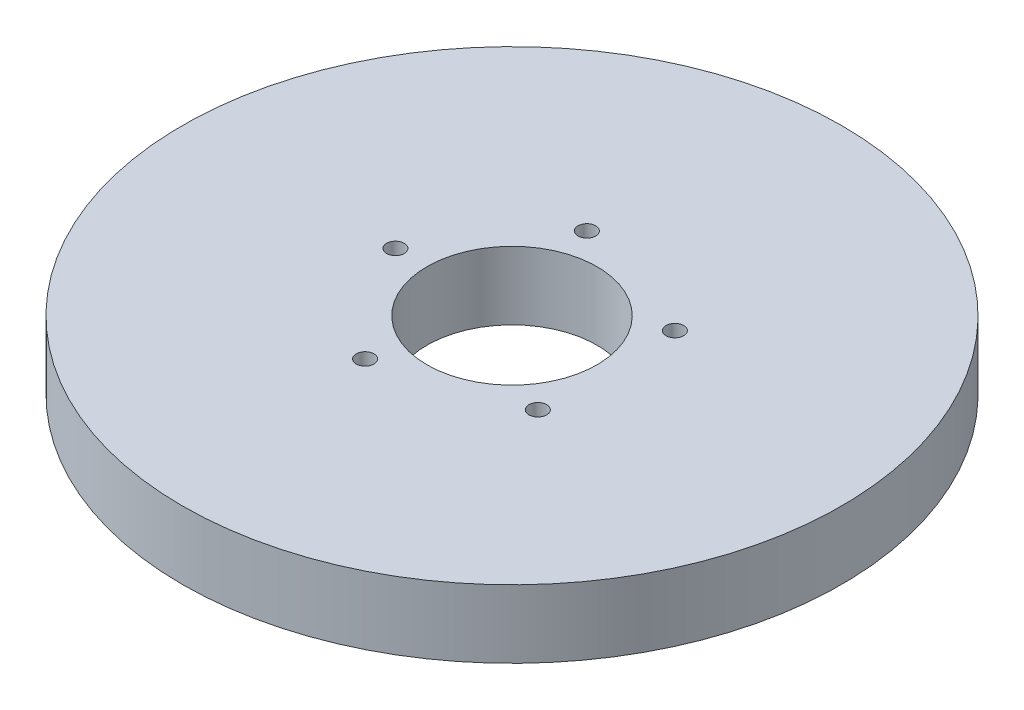
ISO-10303-21;
HEADER;
FILE_DESCRIPTION(('STEP AP214'),'2;1');
FILE_NAME('part.step','',(''),(''),'','','');
FILE_SCHEMA(('AUTOMOTIVE_DESIGN { 1 0 10303 214 1 1 1 1 }'));
ENDSEC;
DATA;
#1=APPLICATION_CONTEXT('core data for automotive mechanical design processes');
#2=APPLICATION_PROTOCOL_DEFINITION('international standard','automotive_design',2000,#1);
#3=PRODUCT_CONTEXT('',#1,'mechanical');
#4=PRODUCT('Part','Part','',(#3));
#5=PRODUCT_RELATED_PRODUCT_CATEGORY('part','',(#4));
#6=PRODUCT_DEFINITION_FORMATION('','',#4);
#7=PRODUCT_DEFINITION_CONTEXT('part definition',#1,'design');
#8=PRODUCT_DEFINITION('design','',#6,#7);
#9=PRODUCT_DEFINITION_SHAPE('','',#8);
#10=(LENGTH_UNIT() NAMED_UNIT(*) SI_UNIT(.MILLI.,.METRE.));
#11=(NAMED_UNIT(*) PLANE_ANGLE_UNIT() SI_UNIT($,.RADIAN.));
#12=(NAMED_UNIT(*) SI_UNIT($,.STERADIAN.) SOLID_ANGLE_UNIT());
#13=UNCERTAINTY_MEASURE_WITH_UNIT(LENGTH_MEASURE(1.E-05),#10,'distance_accuracy_value','');
#14=(GEOMETRIC_REPRESENTATION_CONTEXT(3) GLOBAL_UNCERTAINTY_ASSIGNED_CONTEXT((#13)) GLOBAL_UNIT_ASSIGNED_CONTEXT((#10,
#11,#12)) REPRESENTATION_CONTEXT('',''));
#15=CARTESIAN_POINT('',(0.,0.,0.));
#16=DIRECTION('',(0.,0.,1.));
#17=DIRECTION('',(1.,0.,0.));
#18=AXIS2_PLACEMENT_3D('',#15,#16,#17);
#19=CARTESIAN_POINT('',(0.,16.,0.));
#20=DIRECTION('',(0.,-1.,0.));
#21=DIRECTION('',(0.,0.,-1.));
#22=AXIS2_PLACEMENT_3D('',#19,#20,#21);
#23=CYLINDRICAL_SURFACE('',#22,77.5);
#24=CARTESIAN_POINT('',(0.,16.,0.));
#25=DIRECTION('',(0.,1.,0.));
#26=DIRECTION('',(0.,0.,1.));
#27=AXIS2_PLACEMENT_3D('',#24,#25,#26);
#28=CIRCLE('',#27,77.5);
#29=CARTESIAN_POINT('',(0.,16.,77.5));
#30=VERTEX_POINT('',#29);
#31=EDGE_CURVE('E10',#30,#30,#28,.T.);
#32=ORIENTED_EDGE('',*,*,#31,.F.);
#33=EDGE_LOOP('',(#32));
#34=FACE_BOUND('',#33,.T.);
#35=CARTESIAN_POINT('',(0.,0.,0.));
#36=DIRECTION('',(0.,1.,0.));
#37=DIRECTION('',(0.,0.,1.));
#38=AXIS2_PLACEMENT_3D('',#35,#36,#37);
#39=CIRCLE('',#38,77.5);
#40=CARTESIAN_POINT('',(0.,0.,77.5));
#41=VERTEX_POINT('',#40);
#42=EDGE_CURVE('E37',#41,#41,#39,.T.);
#43=ORIENTED_EDGE('',*,*,#42,.T.);
#44=EDGE_LOOP('',(#43));
#45=FACE_BOUND('',#44,.T.);
#46=ADVANCED_FACE('F40',(#34,#45),#23,.T.);
#47=CARTESIAN_POINT('',(0.,16.,0.));
#48=DIRECTION('',(0.,1.,0.));
#49=DIRECTION('',(0.,0.,1.));
#50=AXIS2_PLACEMENT_3D('',#47,#48,#49);
#51=PLANE('',#50);
#52=CARTESIAN_POINT('',(-8.47301739270724,16.,26.0772661397349));
#53=DIRECTION('',(0.,1.,0.));
#54=DIRECTION('',(0.951056516295155,0.,0.309016994374945));
#55=AXIS2_PLACEMENT_3D('',#52,#53,#54);
#56=CIRCLE('',#55,2.08606824569061);
#57=CARTESIAN_POINT('',(-8.47301739270724,16.,28.1633343854255));
#58=VERTEX_POINT('',#57);
#59=EDGE_CURVE('E78',#58,#58,#56,.T.);
#60=ORIENTED_EDGE('',*,*,#59,.F.);
#61=EDGE_LOOP('',(#60));
#62=FACE_BOUND('',#61,.T.);
#63=CARTESIAN_POINT('',(22.1826475213769,16.,16.1166368080328));
#64=DIRECTION('',(0.,1.,0.));
#65=DIRECTION('',(0.587785252292469,0.,-0.809016994374951));
#66=AXIS2_PLACEMENT_3D('',#63,#64,#65);
#67=CIRCLE('',#66,2.08606824569061);
#68=CARTESIAN_POINT('',(22.1826475213769,16.,18.2027050537234));
#69=VERTEX_POINT('',#68);
#70=EDGE_CURVE('E71',#69,#69,#67,.T.);
#71=ORIENTED_EDGE('',*,*,#70,.F.);
#72=EDGE_LOOP('',(#71));
#73=FACE_BOUND('',#72,.T.);
#74=CARTESIAN_POINT('',(22.1826475213766,16.,-16.1166368080331));
#75=DIRECTION('',(0.,1.,0.));
#76=DIRECTION('',(-0.58778525229248,0.,-0.809016994374942));
#77=AXIS2_PLACEMENT_3D('',#74,#75,#76);
#78=CIRCLE('',#77,2.08606824569061);
#79=CARTESIAN_POINT('',(22.1826475213766,16.,-14.0305685623425));
#80=VERTEX_POINT('',#79);
#81=EDGE_CURVE('E70',#80,#80,#78,.T.);
#82=ORIENTED_EDGE('',*,*,#81,.F.);
#83=EDGE_LOOP('',(#82));
#84=FACE_BOUND('',#83,.T.);
#85=CARTESIAN_POINT('',(-8.47301739270761,16.,-26.0772661397348));
#86=DIRECTION('',(0.,1.,0.));
#87=DIRECTION('',(-0.95105651629515,0.,0.309016994374958));
#88=AXIS2_PLACEMENT_3D('',#85,#86,#87);
#89=CIRCLE('',#88,2.08606824569061);
#90=CARTESIAN_POINT('',(-8.47301739270761,16.,-23.9911978940442));
#91=VERTEX_POINT('',#90);
#92=EDGE_CURVE('E61',#91,#91,#89,.T.);
#93=ORIENTED_EDGE('',*,*,#92,.F.);
#94=EDGE_LOOP('',(#93));
#95=FACE_BOUND('',#94,.T.);
#96=CARTESIAN_POINT('',(-27.4192602573389,16.,0.));
#97=DIRECTION('',(0.,1.,0.));
#98=DIRECTION('',(0.,0.,1.));
#99=AXIS2_PLACEMENT_3D('',#96,#97,#98);
#100=CIRCLE('',#99,2.08606824569061);
#101=CARTESIAN_POINT('',(-27.4192602573389,16.,2.08606824569061));
#102=VERTEX_POINT('',#101);
#103=EDGE_CURVE('E54',#102,#102,#100,.T.);
#104=ORIENTED_EDGE('',*,*,#103,.F.);
#105=EDGE_LOOP('',(#104));
#106=FACE_BOUND('',#105,.T.);
#107=CARTESIAN_POINT('',(0.,16.,0.));
#108=DIRECTION('',(0.,1.,0.));
#109=DIRECTION('',(0.,0.,1.));
#110=AXIS2_PLACEMENT_3D('',#107,#108,#109);
#111=CIRCLE('',#110,20.);
#112=CARTESIAN_POINT('',(0.,16.,20.));
#113=VERTEX_POINT('',#112);
#114=EDGE_CURVE('E50',#113,#113,#111,.T.);
#115=ORIENTED_EDGE('',*,*,#114,.F.);
#116=EDGE_LOOP('',(#115));
#117=FACE_BOUND('',#116,.T.);
#118=ORIENTED_EDGE('',*,*,#31,.T.);
#119=EDGE_LOOP('',(#118));
#120=FACE_BOUND('',#119,.T.);
#121=ADVANCED_FACE('F94',(#62,#73,#84,#95,#106,#117,#120),#51,.T.);
#122=CARTESIAN_POINT('',(0.,0.,0.));
#123=DIRECTION('',(0.,1.,0.));
#124=DIRECTION('',(0.,0.,1.));
#125=AXIS2_PLACEMENT_3D('',#122,#123,#124);
#126=PLANE('',#125);
#127=CARTESIAN_POINT('',(0.,0.,0.));
#128=DIRECTION('',(0.,1.,0.));
#129=DIRECTION('',(0.,0.,1.));
#130=AXIS2_PLACEMENT_3D('',#127,#128,#129);
#131=CIRCLE('',#130,20.);
#132=CARTESIAN_POINT('',(0.,0.,20.));
#133=VERTEX_POINT('',#132);
#134=EDGE_CURVE('E47',#133,#133,#131,.T.);
#135=ORIENTED_EDGE('',*,*,#134,.T.);
#136=EDGE_LOOP('',(#135));
#137=FACE_BOUND('',#136,.T.);
#138=ORIENTED_EDGE('',*,*,#42,.F.);
#139=EDGE_LOOP('',(#138));
#140=FACE_BOUND('',#139,.T.);
#141=ADVANCED_FACE('F100',(#137,#140),#126,.F.);
#142=CARTESIAN_POINT('',(0.,16.,0.));
#143=DIRECTION('',(0.,-1.,0.));
#144=DIRECTION('',(0.,0.,-1.));
#145=AXIS2_PLACEMENT_3D('',#142,#143,#144);
#146=CYLINDRICAL_SURFACE('',#145,20.);
#147=ORIENTED_EDGE('',*,*,#114,.T.);
#148=EDGE_LOOP('',(#147));
#149=FACE_BOUND('',#148,.T.);
#150=ORIENTED_EDGE('',*,*,#134,.F.);
#151=EDGE_LOOP('',(#150));
#152=FACE_BOUND('',#151,.T.);
#153=ADVANCED_FACE('F108',(#149,#152),#146,.F.);
#154=CARTESIAN_POINT('',(-27.4192602573389,1.72376139987765,0.));
#155=DIRECTION('',(0.,1.,0.));
#156=DIRECTION('',(0.,0.,1.));
#157=AXIS2_PLACEMENT_3D('',#154,#155,#156);
#158=CYLINDRICAL_SURFACE('',#157,2.08606824569061);
#159=CARTESIAN_POINT('',(-27.4192602573389,1.72376139987765,0.));
#160=DIRECTION('',(0.,1.,0.));
#161=DIRECTION('',(0.,0.,1.));
#162=AXIS2_PLACEMENT_3D('',#159,#160,#161);
#163=CIRCLE('',#162,2.08606824569061);
#164=CARTESIAN_POINT('',(-27.4192602573389,1.72376139987765,2.08606824569061));
#165=VERTEX_POINT('',#164);
#166=EDGE_CURVE('E55',#165,#165,#163,.T.);
#167=CARTESIAN_POINT('',(-27.4192602573389,1.72376139987765,2.08606824569061));
#168=CARTESIAN_POINT('',(-27.4192602573389,1.87247221862893,2.08606824569061));
#169=CARTESIAN_POINT('',(-27.4192602573389,2.0211830373802,2.08606824569061));
#170=CARTESIAN_POINT('',(-27.4192602573389,2.31860467488275,2.08606824569061));
#171=CARTESIAN_POINT('',(-27.4192602573389,2.46731549363402,2.08606824569061));
#172=CARTESIAN_POINT('',(-27.4192602573389,2.76473713113657,2.08606824569061));
#173=CARTESIAN_POINT('',(-27.4192602573389,2.91344794988785,2.08606824569061));
#174=CARTESIAN_POINT('',(-27.4192602573389,3.2108695873904,2.08606824569061));
#175=CARTESIAN_POINT('',(-27.4192602573389,3.35958040614167,2.08606824569061));
#176=CARTESIAN_POINT('',(-27.4192602573389,3.65700204364422,2.08606824569061));
#177=CARTESIAN_POINT('',(-27.4192602573389,3.8057128623955,2.08606824569061));
#178=CARTESIAN_POINT('',(-27.4192602573389,4.10313449989804,2.08606824569061));
#179=CARTESIAN_POINT('',(-27.4192602573389,4.25184531864932,2.08606824569061));
#180=CARTESIAN_POINT('',(-27.4192602573389,4.54926695615187,2.08606824569061));
#181=CARTESIAN_POINT('',(-27.4192602573389,4.69797777490314,2.08606824569061));
#182=CARTESIAN_POINT('',(-27.4192602573389,4.99539941240569,2.08606824569061));
#183=CARTESIAN_POINT('',(-27.4192602573389,5.14411023115696,2.08606824569061));
#184=CARTESIAN_POINT('',(-27.4192602573389,5.44153186865951,2.08606824569061));
#185=CARTESIAN_POINT('',(-27.4192602573389,5.59024268741079,2.08606824569061));
#186=CARTESIAN_POINT('',(-27.4192602573389,5.88766432491334,2.08606824569061));
#187=CARTESIAN_POINT('',(-27.4192602573389,6.03637514366461,2.08606824569061));
#188=CARTESIAN_POINT('',(-27.4192602573389,6.33379678116716,2.08606824569061));
#189=CARTESIAN_POINT('',(-27.4192602573389,6.48250759991843,2.08606824569061));
#190=CARTESIAN_POINT('',(-27.4192602573389,6.77992923742098,2.08606824569061));
#191=CARTESIAN_POINT('',(-27.4192602573389,6.92864005617226,2.08606824569061));
#192=CARTESIAN_POINT('',(-27.4192602573389,7.22606169367481,2.08606824569061));
#193=CARTESIAN_POINT('',(-27.4192602573389,7.37477251242608,2.08606824569061));
#194=CARTESIAN_POINT('',(-27.4192602573389,7.67219414992863,2.08606824569061));
#195=CARTESIAN_POINT('',(-27.4192602573389,7.8209049686799,2.08606824569061));
#196=CARTESIAN_POINT('',(-27.4192602573389,8.11832660618245,2.08606824569061));
#197=CARTESIAN_POINT('',(-27.4192602573389,8.26703742493373,2.08606824569061));
#198=CARTESIAN_POINT('',(-27.4192602573389,8.56445906243628,2.08606824569061));
#199=CARTESIAN_POINT('',(-27.4192602573389,8.71316988118755,2.08606824569061));
#200=CARTESIAN_POINT('',(-27.4192602573389,9.0105915186901,2.08606824569061));
#201=CARTESIAN_POINT('',(-27.4192602573389,9.15930233744137,2.08606824569061));
#202=CARTESIAN_POINT('',(-27.4192602573389,9.45672397494392,2.08606824569061));
#203=CARTESIAN_POINT('',(-27.4192602573389,9.6054347936952,2.08606824569061));
#204=CARTESIAN_POINT('',(-27.4192602573389,9.90285643119775,2.08606824569061));
#205=CARTESIAN_POINT('',(-27.4192602573389,10.051567249949,2.08606824569061));
#206=CARTESIAN_POINT('',(-27.4192602573389,10.3489888874516,2.08606824569061));
#207=CARTESIAN_POINT('',(-27.4192602573389,10.4976997062028,2.08606824569061));
#208=CARTESIAN_POINT('',(-27.4192602573389,10.7951213437054,2.08606824569061));
#209=CARTESIAN_POINT('',(-27.4192602573389,10.9438321624567,2.08606824569061));
#210=CARTESIAN_POINT('',(-27.4192602573389,11.2412537999592,2.08606824569061));
#211=CARTESIAN_POINT('',(-27.4192602573389,11.3899646187105,2.08606824569061));
#212=CARTESIAN_POINT('',(-27.4192602573389,11.687386256213,2.08606824569061));
#213=CARTESIAN_POINT('',(-27.4192602573389,11.8360970749643,2.08606824569061));
#214=CARTESIAN_POINT('',(-27.4192602573389,12.1335187124669,2.08606824569061));
#215=CARTESIAN_POINT('',(-27.4192602573389,12.2822295312181,2.08606824569061));
#216=CARTESIAN_POINT('',(-27.4192602573389,12.5796511687207,2.08606824569061));
#217=CARTESIAN_POINT('',(-27.4192602573389,12.728361987472,2.08606824569061));
#218=CARTESIAN_POINT('',(-27.4192602573389,13.0257836249745,2.08606824569061));
#219=CARTESIAN_POINT('',(-27.4192602573389,13.1744944437258,2.08606824569061));
#220=CARTESIAN_POINT('',(-27.4192602573389,13.4719160812283,2.08606824569061));
#221=CARTESIAN_POINT('',(-27.4192602573389,13.6206268999796,2.08606824569061));
#222=CARTESIAN_POINT('',(-27.4192602573389,13.9180485374822,2.08606824569061));
#223=CARTESIAN_POINT('',(-27.4192602573389,14.0667593562334,2.08606824569061));
#224=CARTESIAN_POINT('',(-27.4192602573389,14.364180993736,2.08606824569061));
#225=CARTESIAN_POINT('',(-27.4192602573389,14.5128918124873,2.08606824569061));
#226=CARTESIAN_POINT('',(-27.4192602573389,14.8103134499898,2.08606824569061));
#227=CARTESIAN_POINT('',(-27.4192602573389,14.9590242687411,2.08606824569061));
#228=CARTESIAN_POINT('',(-27.4192602573389,15.2564459062436,2.08606824569061));
#229=CARTESIAN_POINT('',(-27.4192602573389,15.4051567249949,2.08606824569061));
#230=CARTESIAN_POINT('',(-27.4192602573389,15.7025783624974,2.08606824569061));
#231=CARTESIAN_POINT('',(-27.4192602573389,15.8512891812487,2.08606824569061));
#232=CARTESIAN_POINT('',(-27.4192602573389,16.,2.08606824569061));
#233=B_SPLINE_CURVE_WITH_KNOTS('',3,(#167,#168,#169,#170,#171,#172,#173,#174,#175,#176,#177,
#178,#179,#180,#181,#182,#183,#184,#185,#186,#187,#188,#189,#190,#191,#192,#193,#194,#195,#196,
#197,#198,#199,#200,#201,#202,#203,#204,#205,#206,#207,#208,#209,#210,#211,#212,#213,#214,#215,
#216,#217,#218,#219,#220,#221,#222,#223,#224,#225,#226,#227,#228,#229,#230,#231,#232),
.UNSPECIFIED.,.F.,.F.,(4,2,2,2,2,2,2,2,2,2,2,2,2,2,2,2,2,2,2,2,2,2,2,2,2,2,2,2,2,2,2,2,4),(0.,
0.446132456253823,0.892264912507647,1.33839736876147,1.78452982501529,2.23066228126912,
2.67679473752294,3.12292719377676,3.56905965003059,4.01519210628441,4.46132456253823,
4.90745701879206,5.35358947504588,5.7997219312997,6.24585438755353,6.69198684380735,
7.13811930006117,7.584251756315,8.03038421256882,8.47651666882264,8.92264912507647,
9.36878158133029,9.81491403758411,10.2610464938379,10.7071789500918,11.1533114063456,
11.5994438625994,12.0455763188532,12.4917087751071,12.9378412313609,13.3839736876147,
13.8301061438685,14.2762386001223),.UNSPECIFIED.);
#234=EDGE_CURVE('BSEAM115',#165,#102,#233,.T.);
#235=ORIENTED_EDGE('',*,*,#166,.F.);
#236=ORIENTED_EDGE('',*,*,#103,.T.);
#237=ORIENTED_EDGE('',*,*,#234,.T.);
#238=ORIENTED_EDGE('',*,*,#234,.F.);
#239=EDGE_LOOP('',(#235,#237,#236,#238));
#240=FACE_BOUND('',#239,.T.);
#241=ADVANCED_FACE('F115',(#240),#158,.F.);
#242=CARTESIAN_POINT('',(-27.4192602573389,1.72376139987765,0.));
#243=DIRECTION('',(0.,1.,0.));
#244=DIRECTION('',(0.,0.,1.));
#245=AXIS2_PLACEMENT_3D('',#242,#243,#244);
#246=PLANE('',#245);
#247=ORIENTED_EDGE('',*,*,#166,.T.);
#248=EDGE_LOOP('',(#247));
#249=FACE_BOUND('',#248,.T.);
#250=ADVANCED_FACE('F142',(#249),#246,.T.);
#251=CARTESIAN_POINT('',(-8.47301739270761,1.72376139987765,-26.0772661397348));
#252=DIRECTION('',(0.,1.,0.));
#253=DIRECTION('',(0.,0.,1.));
#254=AXIS2_PLACEMENT_3D('',#251,#252,#253);
#255=CYLINDRICAL_SURFACE('',#254,2.08606824569061);
#256=CARTESIAN_POINT('',(-8.47301739270761,1.72376139987765,-26.0772661397348));
#257=DIRECTION('',(0.,1.,0.));
#258=DIRECTION('',(-0.95105651629515,0.,0.309016994374958));
#259=AXIS2_PLACEMENT_3D('',#256,#257,#258);
#260=CIRCLE('',#259,2.08606824569061);
#261=CARTESIAN_POINT('',(-8.47301739270761,1.72376139987765,-23.9911978940442));
#262=VERTEX_POINT('',#261);
#263=EDGE_CURVE('E63',#262,#262,#260,.T.);
#264=CARTESIAN_POINT('',(-8.47301739270761,1.72376139987765,-23.9911978940442));
#265=CARTESIAN_POINT('',(-8.47301739270761,1.87247221862893,-23.9911978940442));
#266=CARTESIAN_POINT('',(-8.47301739270761,2.0211830373802,-23.9911978940442));
#267=CARTESIAN_POINT('',(-8.47301739270761,2.31860467488275,-23.9911978940442));
#268=CARTESIAN_POINT('',(-8.47301739270761,2.46731549363402,-23.9911978940442));
#269=CARTESIAN_POINT('',(-8.47301739270761,2.76473713113657,-23.9911978940442));
#270=CARTESIAN_POINT('',(-8.47301739270761,2.91344794988785,-23.9911978940442));
#271=CARTESIAN_POINT('',(-8.47301739270761,3.2108695873904,-23.9911978940442));
#272=CARTESIAN_POINT('',(-8.47301739270761,3.35958040614167,-23.9911978940442));
#273=CARTESIAN_POINT('',(-8.47301739270761,3.65700204364422,-23.9911978940442));
#274=CARTESIAN_POINT('',(-8.47301739270761,3.8057128623955,-23.9911978940442));
#275=CARTESIAN_POINT('',(-8.47301739270761,4.10313449989804,-23.9911978940442));
#276=CARTESIAN_POINT('',(-8.47301739270761,4.25184531864932,-23.9911978940442));
#277=CARTESIAN_POINT('',(-8.47301739270761,4.54926695615187,-23.9911978940442));
#278=CARTESIAN_POINT('',(-8.47301739270761,4.69797777490314,-23.9911978940442));
#279=CARTESIAN_POINT('',(-8.47301739270761,4.99539941240569,-23.9911978940442));
#280=CARTESIAN_POINT('',(-8.47301739270761,5.14411023115696,-23.9911978940442));
#281=CARTESIAN_POINT('',(-8.47301739270761,5.44153186865951,-23.9911978940442));
#282=CARTESIAN_POINT('',(-8.47301739270761,5.59024268741079,-23.9911978940442));
#283=CARTESIAN_POINT('',(-8.47301739270761,5.88766432491334,-23.9911978940442));
#284=CARTESIAN_POINT('',(-8.47301739270761,6.03637514366461,-23.9911978940442));
#285=CARTESIAN_POINT('',(-8.47301739270761,6.33379678116716,-23.9911978940442));
#286=CARTESIAN_POINT('',(-8.47301739270761,6.48250759991843,-23.9911978940442));
#287=CARTESIAN_POINT('',(-8.47301739270761,6.77992923742098,-23.9911978940442));
#288=CARTESIAN_POINT('',(-8.47301739270761,6.92864005617226,-23.9911978940442));
#289=CARTESIAN_POINT('',(-8.47301739270761,7.22606169367481,-23.9911978940442));
#290=CARTESIAN_POINT('',(-8.47301739270761,7.37477251242608,-23.9911978940442));
#291=CARTESIAN_POINT('',(-8.47301739270761,7.67219414992863,-23.9911978940442));
#292=CARTESIAN_POINT('',(-8.47301739270761,7.8209049686799,-23.9911978940442));
#293=CARTESIAN_POINT('',(-8.47301739270761,8.11832660618245,-23.9911978940442));
#294=CARTESIAN_POINT('',(-8.47301739270761,8.26703742493373,-23.9911978940442));
#295=CARTESIAN_POINT('',(-8.47301739270761,8.56445906243628,-23.9911978940442));
#296=CARTESIAN_POINT('',(-8.47301739270761,8.71316988118755,-23.9911978940442));
#297=CARTESIAN_POINT('',(-8.47301739270761,9.0105915186901,-23.9911978940442));
#298=CARTESIAN_POINT('',(-8.47301739270761,9.15930233744137,-23.9911978940442));
#299=CARTESIAN_POINT('',(-8.47301739270761,9.45672397494392,-23.9911978940442));
#300=CARTESIAN_POINT('',(-8.47301739270761,9.6054347936952,-23.9911978940442));
#301=CARTESIAN_POINT('',(-8.47301739270761,9.90285643119775,-23.9911978940442));
#302=CARTESIAN_POINT('',(-8.47301739270761,10.051567249949,-23.9911978940442));
#303=CARTESIAN_POINT('',(-8.47301739270761,10.3489888874516,-23.9911978940442));
#304=CARTESIAN_POINT('',(-8.47301739270761,10.4976997062028,-23.9911978940442));
#305=CARTESIAN_POINT('',(-8.47301739270761,10.7951213437054,-23.9911978940442));
#306=CARTESIAN_POINT('',(-8.47301739270761,10.9438321624567,-23.9911978940442));
#307=CARTESIAN_POINT('',(-8.47301739270761,11.2412537999592,-23.9911978940442));
#308=CARTESIAN_POINT('',(-8.47301739270761,11.3899646187105,-23.9911978940442));
#309=CARTESIAN_POINT('',(-8.47301739270761,11.687386256213,-23.9911978940442));
#310=CARTESIAN_POINT('',(-8.47301739270761,11.8360970749643,-23.9911978940442));
#311=CARTESIAN_POINT('',(-8.47301739270761,12.1335187124669,-23.9911978940442));
#312=CARTESIAN_POINT('',(-8.47301739270761,12.2822295312181,-23.9911978940442));
#313=CARTESIAN_POINT('',(-8.47301739270761,12.5796511687207,-23.9911978940442));
#314=CARTESIAN_POINT('',(-8.47301739270761,12.728361987472,-23.9911978940442));
#315=CARTESIAN_POINT('',(-8.47301739270761,13.0257836249745,-23.9911978940442));
#316=CARTESIAN_POINT('',(-8.47301739270761,13.1744944437258,-23.9911978940442));
#317=CARTESIAN_POINT('',(-8.47301739270761,13.4719160812283,-23.9911978940442));
#318=CARTESIAN_POINT('',(-8.47301739270761,13.6206268999796,-23.9911978940442));
#319=CARTESIAN_POINT('',(-8.47301739270761,13.9180485374822,-23.9911978940442));
#320=CARTESIAN_POINT('',(-8.47301739270761,14.0667593562334,-23.9911978940442));
#321=CARTESIAN_POINT('',(-8.47301739270761,14.364180993736,-23.9911978940442));
#322=CARTESIAN_POINT('',(-8.47301739270761,14.5128918124873,-23.9911978940442));
#323=CARTESIAN_POINT('',(-8.47301739270761,14.8103134499898,-23.9911978940442));
#324=CARTESIAN_POINT('',(-8.47301739270761,14.9590242687411,-23.9911978940442));
#325=CARTESIAN_POINT('',(-8.47301739270761,15.2564459062436,-23.9911978940442));
#326=CARTESIAN_POINT('',(-8.47301739270761,15.4051567249949,-23.9911978940442));
#327=CARTESIAN_POINT('',(-8.47301739270761,15.7025783624974,-23.9911978940442));
#328=CARTESIAN_POINT('',(-8.47301739270761,15.8512891812487,-23.9911978940442));
#329=CARTESIAN_POINT('',(-8.47301739270761,16.,-23.9911978940442));
#330=B_SPLINE_CURVE_WITH_KNOTS('',3,(#264,#265,#266,#267,#268,#269,#270,#271,#272,#273,#274,
#275,#276,#277,#278,#279,#280,#281,#282,#283,#284,#285,#286,#287,#288,#289,#290,#291,#292,#293,
#294,#295,#296,#297,#298,#299,#300,#301,#302,#303,#304,#305,#306,#307,#308,#309,#310,#311,#312,
#313,#314,#315,#316,#317,#318,#319,#320,#321,#322,#323,#324,#325,#326,#327,#328,#329),
.UNSPECIFIED.,.F.,.F.,(4,2,2,2,2,2,2,2,2,2,2,2,2,2,2,2,2,2,2,2,2,2,2,2,2,2,2,2,2,2,2,2,4),(0.,
0.446132456253823,0.892264912507647,1.33839736876147,1.78452982501529,2.23066228126912,
2.67679473752294,3.12292719377676,3.56905965003059,4.01519210628441,4.46132456253823,
4.90745701879206,5.35358947504588,5.7997219312997,6.24585438755353,6.69198684380735,
7.13811930006117,7.584251756315,8.03038421256882,8.47651666882264,8.92264912507647,
9.36878158133029,9.81491403758411,10.2610464938379,10.7071789500918,11.1533114063456,
11.5994438625994,12.0455763188532,12.4917087751071,12.9378412313609,13.3839736876147,
13.8301061438685,14.2762386001223),.UNSPECIFIED.);
#331=EDGE_CURVE('BSEAM147',#262,#91,#330,.T.);
#332=ORIENTED_EDGE('',*,*,#263,.F.);
#333=ORIENTED_EDGE('',*,*,#92,.T.);
#334=ORIENTED_EDGE('',*,*,#331,.T.);
#335=ORIENTED_EDGE('',*,*,#331,.F.);
#336=EDGE_LOOP('',(#332,#334,#333,#335));
#337=FACE_BOUND('',#336,.T.);
#338=ADVANCED_FACE('F147',(#337),#255,.F.);
#339=CARTESIAN_POINT('',(-8.47301739270761,1.72376139987765,-26.0772661397348));
#340=DIRECTION('',(0.,1.,0.));
#341=DIRECTION('',(-0.95105651629515,0.,0.309016994374958));
#342=AXIS2_PLACEMENT_3D('',#339,#340,#341);
#343=PLANE('',#342);
#344=ORIENTED_EDGE('',*,*,#263,.T.);
#345=EDGE_LOOP('',(#344));
#346=FACE_BOUND('',#345,.T.);
#347=ADVANCED_FACE('F163',(#346),#343,.T.);
#348=CARTESIAN_POINT('',(22.1826475213766,1.72376139987765,-16.1166368080331));
#349=DIRECTION('',(0.,1.,0.));
#350=DIRECTION('',(0.,0.,1.));
#351=AXIS2_PLACEMENT_3D('',#348,#349,#350);
#352=CYLINDRICAL_SURFACE('',#351,2.08606824569061);
#353=CARTESIAN_POINT('',(22.1826475213766,1.72376139987765,-16.1166368080331));
#354=DIRECTION('',(0.,1.,0.));
#355=DIRECTION('',(-0.58778525229248,0.,-0.809016994374942));
#356=AXIS2_PLACEMENT_3D('',#353,#354,#355);
#357=CIRCLE('',#356,2.08606824569061);
#358=CARTESIAN_POINT('',(22.1826475213766,1.72376139987765,-14.0305685623425));
#359=VERTEX_POINT('',#358);
#360=EDGE_CURVE('E69',#359,#359,#357,.T.);
#361=CARTESIAN_POINT('',(22.1826475213766,1.72376139987765,-14.0305685623425));
#362=CARTESIAN_POINT('',(22.1826475213766,1.87247221862893,-14.0305685623425));
#363=CARTESIAN_POINT('',(22.1826475213766,2.0211830373802,-14.0305685623425));
#364=CARTESIAN_POINT('',(22.1826475213766,2.31860467488275,-14.0305685623425));
#365=CARTESIAN_POINT('',(22.1826475213766,2.46731549363402,-14.0305685623425));
#366=CARTESIAN_POINT('',(22.1826475213766,2.76473713113657,-14.0305685623425));
#367=CARTESIAN_POINT('',(22.1826475213766,2.91344794988785,-14.0305685623425));
#368=CARTESIAN_POINT('',(22.1826475213766,3.2108695873904,-14.0305685623425));
#369=CARTESIAN_POINT('',(22.1826475213766,3.35958040614167,-14.0305685623425));
#370=CARTESIAN_POINT('',(22.1826475213766,3.65700204364422,-14.0305685623425));
#371=CARTESIAN_POINT('',(22.1826475213766,3.8057128623955,-14.0305685623425));
#372=CARTESIAN_POINT('',(22.1826475213766,4.10313449989804,-14.0305685623425));
#373=CARTESIAN_POINT('',(22.1826475213766,4.25184531864932,-14.0305685623425));
#374=CARTESIAN_POINT('',(22.1826475213766,4.54926695615187,-14.0305685623425));
#375=CARTESIAN_POINT('',(22.1826475213766,4.69797777490314,-14.0305685623425));
#376=CARTESIAN_POINT('',(22.1826475213766,4.99539941240569,-14.0305685623425));
#377=CARTESIAN_POINT('',(22.1826475213766,5.14411023115696,-14.0305685623425));
#378=CARTESIAN_POINT('',(22.1826475213766,5.44153186865951,-14.0305685623425));
#379=CARTESIAN_POINT('',(22.1826475213766,5.59024268741079,-14.0305685623425));
#380=CARTESIAN_POINT('',(22.1826475213766,5.88766432491334,-14.0305685623425));
#381=CARTESIAN_POINT('',(22.1826475213766,6.03637514366461,-14.0305685623425));
#382=CARTESIAN_POINT('',(22.1826475213766,6.33379678116716,-14.0305685623425));
#383=CARTESIAN_POINT('',(22.1826475213766,6.48250759991843,-14.0305685623425));
#384=CARTESIAN_POINT('',(22.1826475213766,6.77992923742098,-14.0305685623425));
#385=CARTESIAN_POINT('',(22.1826475213766,6.92864005617226,-14.0305685623425));
#386=CARTESIAN_POINT('',(22.1826475213766,7.22606169367481,-14.0305685623425));
#387=CARTESIAN_POINT('',(22.1826475213766,7.37477251242608,-14.0305685623425));
#388=CARTESIAN_POINT('',(22.1826475213766,7.67219414992863,-14.0305685623425));
#389=CARTESIAN_POINT('',(22.1826475213766,7.8209049686799,-14.0305685623425));
#390=CARTESIAN_POINT('',(22.1826475213766,8.11832660618245,-14.0305685623425));
#391=CARTESIAN_POINT('',(22.1826475213766,8.26703742493373,-14.0305685623425));
#392=CARTESIAN_POINT('',(22.1826475213766,8.56445906243628,-14.0305685623425));
#393=CARTESIAN_POINT('',(22.1826475213766,8.71316988118755,-14.0305685623425));
#394=CARTESIAN_POINT('',(22.1826475213766,9.0105915186901,-14.0305685623425));
#395=CARTESIAN_POINT('',(22.1826475213766,9.15930233744137,-14.0305685623425));
#396=CARTESIAN_POINT('',(22.1826475213766,9.45672397494392,-14.0305685623425));
#397=CARTESIAN_POINT('',(22.1826475213766,9.6054347936952,-14.0305685623425));
#398=CARTESIAN_POINT('',(22.1826475213766,9.90285643119775,-14.0305685623425));
#399=CARTESIAN_POINT('',(22.1826475213766,10.051567249949,-14.0305685623425));
#400=CARTESIAN_POINT('',(22.1826475213766,10.3489888874516,-14.0305685623425));
#401=CARTESIAN_POINT('',(22.1826475213766,10.4976997062028,-14.0305685623425));
#402=CARTESIAN_POINT('',(22.1826475213766,10.7951213437054,-14.0305685623425));
#403=CARTESIAN_POINT('',(22.1826475213766,10.9438321624567,-14.0305685623425));
#404=CARTESIAN_POINT('',(22.1826475213766,11.2412537999592,-14.0305685623425));
#405=CARTESIAN_POINT('',(22.1826475213766,11.3899646187105,-14.0305685623425));
#406=CARTESIAN_POINT('',(22.1826475213766,11.687386256213,-14.0305685623425));
#407=CARTESIAN_POINT('',(22.1826475213766,11.8360970749643,-14.0305685623425));
#408=CARTESIAN_POINT('',(22.1826475213766,12.1335187124669,-14.0305685623425));
#409=CARTESIAN_POINT('',(22.1826475213766,12.2822295312181,-14.0305685623425));
#410=CARTESIAN_POINT('',(22.1826475213766,12.5796511687207,-14.0305685623425));
#411=CARTESIAN_POINT('',(22.1826475213766,12.728361987472,-14.0305685623425));
#412=CARTESIAN_POINT('',(22.1826475213766,13.0257836249745,-14.0305685623425));
#413=CARTESIAN_POINT('',(22.1826475213766,13.1744944437258,-14.0305685623425));
#414=CARTESIAN_POINT('',(22.1826475213766,13.4719160812283,-14.0305685623425));
#415=CARTESIAN_POINT('',(22.1826475213766,13.6206268999796,-14.0305685623425));
#416=CARTESIAN_POINT('',(22.1826475213766,13.9180485374822,-14.0305685623425));
#417=CARTESIAN_POINT('',(22.1826475213766,14.0667593562334,-14.0305685623425));
#418=CARTESIAN_POINT('',(22.1826475213766,14.364180993736,-14.0305685623425));
#419=CARTESIAN_POINT('',(22.1826475213766,14.5128918124873,-14.0305685623425));
#420=CARTESIAN_POINT('',(22.1826475213766,14.8103134499898,-14.0305685623425));
#421=CARTESIAN_POINT('',(22.1826475213766,14.9590242687411,-14.0305685623425));
#422=CARTESIAN_POINT('',(22.1826475213766,15.2564459062436,-14.0305685623425));
#423=CARTESIAN_POINT('',(22.1826475213766,15.4051567249949,-14.0305685623425));
#424=CARTESIAN_POINT('',(22.1826475213766,15.7025783624974,-14.0305685623425));
#425=CARTESIAN_POINT('',(22.1826475213766,15.8512891812487,-14.0305685623425));
#426=CARTESIAN_POINT('',(22.1826475213766,16.,-14.0305685623425));
#427=B_SPLINE_CURVE_WITH_KNOTS('',3,(#361,#362,#363,#364,#365,#366,#367,#368,#369,#370,#371,
#372,#373,#374,#375,#376,#377,#378,#379,#380,#381,#382,#383,#384,#385,#386,#387,#388,#389,#390,
#391,#392,#393,#394,#395,#396,#397,#398,#399,#400,#401,#402,#403,#404,#405,#406,#407,#408,#409,
#410,#411,#412,#413,#414,#415,#416,#417,#418,#419,#420,#421,#422,#423,#424,#425,#426),
.UNSPECIFIED.,.F.,.F.,(4,2,2,2,2,2,2,2,2,2,2,2,2,2,2,2,2,2,2,2,2,2,2,2,2,2,2,2,2,2,2,2,4),(0.,
0.446132456253823,0.892264912507647,1.33839736876147,1.78452982501529,2.23066228126912,
2.67679473752294,3.12292719377676,3.56905965003059,4.01519210628441,4.46132456253823,
4.90745701879206,5.35358947504588,5.7997219312997,6.24585438755353,6.69198684380735,
7.13811930006117,7.584251756315,8.03038421256882,8.47651666882264,8.92264912507647,
9.36878158133029,9.81491403758411,10.2610464938379,10.7071789500918,11.1533114063456,
11.5994438625994,12.0455763188532,12.4917087751071,12.9378412313609,13.3839736876147,
13.8301061438685,14.2762386001223),.UNSPECIFIED.);
#428=EDGE_CURVE('BSEAM172',#359,#80,#427,.T.);
#429=ORIENTED_EDGE('',*,*,#360,.F.);
#430=ORIENTED_EDGE('',*,*,#81,.T.);
#431=ORIENTED_EDGE('',*,*,#428,.T.);
#432=ORIENTED_EDGE('',*,*,#428,.F.);
#433=EDGE_LOOP('',(#429,#431,#430,#432));
#434=FACE_BOUND('',#433,.T.);
#435=ADVANCED_FACE('F172',(#434),#352,.F.);
#436=CARTESIAN_POINT('',(22.1826475213766,1.72376139987765,-16.1166368080331));
#437=DIRECTION('',(0.,1.,0.));
#438=DIRECTION('',(-0.58778525229248,0.,-0.809016994374942));
#439=AXIS2_PLACEMENT_3D('',#436,#437,#438);
#440=PLANE('',#439);
#441=ORIENTED_EDGE('',*,*,#360,.T.);
#442=EDGE_LOOP('',(#441));
#443=FACE_BOUND('',#442,.T.);
#444=ADVANCED_FACE('F185',(#443),#440,.T.);
#445=CARTESIAN_POINT('',(22.1826475213769,1.72376139987765,16.1166368080328));
#446=DIRECTION('',(0.,1.,0.));
#447=DIRECTION('',(0.,0.,1.));
#448=AXIS2_PLACEMENT_3D('',#445,#446,#447);
#449=CYLINDRICAL_SURFACE('',#448,2.08606824569061);
#450=CARTESIAN_POINT('',(22.1826475213769,1.72376139987765,16.1166368080328));
#451=DIRECTION('',(0.,1.,0.));
#452=DIRECTION('',(0.587785252292469,0.,-0.809016994374951));
#453=AXIS2_PLACEMENT_3D('',#450,#451,#452);
#454=CIRCLE('',#453,2.08606824569061);
#455=CARTESIAN_POINT('',(22.1826475213769,1.72376139987765,18.2027050537234));
#456=VERTEX_POINT('',#455);
#457=EDGE_CURVE('E76',#456,#456,#454,.T.);
#458=CARTESIAN_POINT('',(22.1826475213769,1.72376139987765,18.2027050537234));
#459=CARTESIAN_POINT('',(22.1826475213769,1.87247221862893,18.2027050537234));
#460=CARTESIAN_POINT('',(22.1826475213769,2.0211830373802,18.2027050537234));
#461=CARTESIAN_POINT('',(22.1826475213769,2.31860467488275,18.2027050537234));
#462=CARTESIAN_POINT('',(22.1826475213769,2.46731549363402,18.2027050537234));
#463=CARTESIAN_POINT('',(22.1826475213769,2.76473713113657,18.2027050537234));
#464=CARTESIAN_POINT('',(22.1826475213769,2.91344794988785,18.2027050537234));
#465=CARTESIAN_POINT('',(22.1826475213769,3.2108695873904,18.2027050537234));
#466=CARTESIAN_POINT('',(22.1826475213769,3.35958040614167,18.2027050537234));
#467=CARTESIAN_POINT('',(22.1826475213769,3.65700204364422,18.2027050537234));
#468=CARTESIAN_POINT('',(22.1826475213769,3.8057128623955,18.2027050537234));
#469=CARTESIAN_POINT('',(22.1826475213769,4.10313449989804,18.2027050537234));
#470=CARTESIAN_POINT('',(22.1826475213769,4.25184531864932,18.2027050537234));
#471=CARTESIAN_POINT('',(22.1826475213769,4.54926695615187,18.2027050537234));
#472=CARTESIAN_POINT('',(22.1826475213769,4.69797777490314,18.2027050537234));
#473=CARTESIAN_POINT('',(22.1826475213769,4.99539941240569,18.2027050537234));
#474=CARTESIAN_POINT('',(22.1826475213769,5.14411023115696,18.2027050537234));
#475=CARTESIAN_POINT('',(22.1826475213769,5.44153186865951,18.2027050537234));
#476=CARTESIAN_POINT('',(22.1826475213769,5.59024268741079,18.2027050537234));
#477=CARTESIAN_POINT('',(22.1826475213769,5.88766432491334,18.2027050537234));
#478=CARTESIAN_POINT('',(22.1826475213769,6.03637514366461,18.2027050537234));
#479=CARTESIAN_POINT('',(22.1826475213769,6.33379678116716,18.2027050537234));
#480=CARTESIAN_POINT('',(22.1826475213769,6.48250759991843,18.2027050537234));
#481=CARTESIAN_POINT('',(22.1826475213769,6.77992923742098,18.2027050537234));
#482=CARTESIAN_POINT('',(22.1826475213769,6.92864005617226,18.2027050537234));
#483=CARTESIAN_POINT('',(22.1826475213769,7.22606169367481,18.2027050537234));
#484=CARTESIAN_POINT('',(22.1826475213769,7.37477251242608,18.2027050537234));
#485=CARTESIAN_POINT('',(22.1826475213769,7.67219414992863,18.2027050537234));
#486=CARTESIAN_POINT('',(22.1826475213769,7.8209049686799,18.2027050537234));
#487=CARTESIAN_POINT('',(22.1826475213769,8.11832660618245,18.2027050537234));
#488=CARTESIAN_POINT('',(22.1826475213769,8.26703742493373,18.2027050537234));
#489=CARTESIAN_POINT('',(22.1826475213769,8.56445906243628,18.2027050537234));
#490=CARTESIAN_POINT('',(22.1826475213769,8.71316988118755,18.2027050537234));
#491=CARTESIAN_POINT('',(22.1826475213769,9.0105915186901,18.2027050537234));
#492=CARTESIAN_POINT('',(22.1826475213769,9.15930233744137,18.2027050537234));
#493=CARTESIAN_POINT('',(22.1826475213769,9.45672397494392,18.2027050537234));
#494=CARTESIAN_POINT('',(22.1826475213769,9.6054347936952,18.2027050537234));
#495=CARTESIAN_POINT('',(22.1826475213769,9.90285643119775,18.2027050537234));
#496=CARTESIAN_POINT('',(22.1826475213769,10.051567249949,18.2027050537234));
#497=CARTESIAN_POINT('',(22.1826475213769,10.3489888874516,18.2027050537234));
#498=CARTESIAN_POINT('',(22.1826475213769,10.4976997062028,18.2027050537234));
#499=CARTESIAN_POINT('',(22.1826475213769,10.7951213437054,18.2027050537234));
#500=CARTESIAN_POINT('',(22.1826475213769,10.9438321624567,18.2027050537234));
#501=CARTESIAN_POINT('',(22.1826475213769,11.2412537999592,18.2027050537234));
#502=CARTESIAN_POINT('',(22.1826475213769,11.3899646187105,18.2027050537234));
#503=CARTESIAN_POINT('',(22.1826475213769,11.687386256213,18.2027050537234));
#504=CARTESIAN_POINT('',(22.1826475213769,11.8360970749643,18.2027050537234));
#505=CARTESIAN_POINT('',(22.1826475213769,12.1335187124669,18.2027050537234));
#506=CARTESIAN_POINT('',(22.1826475213769,12.2822295312181,18.2027050537234));
#507=CARTESIAN_POINT('',(22.1826475213769,12.5796511687207,18.2027050537234));
#508=CARTESIAN_POINT('',(22.1826475213769,12.728361987472,18.2027050537234));
#509=CARTESIAN_POINT('',(22.1826475213769,13.0257836249745,18.2027050537234));
#510=CARTESIAN_POINT('',(22.1826475213769,13.1744944437258,18.2027050537234));
#511=CARTESIAN_POINT('',(22.1826475213769,13.4719160812283,18.2027050537234));
#512=CARTESIAN_POINT('',(22.1826475213769,13.6206268999796,18.2027050537234));
#513=CARTESIAN_POINT('',(22.1826475213769,13.9180485374822,18.2027050537234));
#514=CARTESIAN_POINT('',(22.1826475213769,14.0667593562334,18.2027050537234));
#515=CARTESIAN_POINT('',(22.1826475213769,14.364180993736,18.2027050537234));
#516=CARTESIAN_POINT('',(22.1826475213769,14.5128918124873,18.2027050537234));
#517=CARTESIAN_POINT('',(22.1826475213769,14.8103134499898,18.2027050537234));
#518=CARTESIAN_POINT('',(22.1826475213769,14.9590242687411,18.2027050537234));
#519=CARTESIAN_POINT('',(22.1826475213769,15.2564459062436,18.2027050537234));
#520=CARTESIAN_POINT('',(22.1826475213769,15.4051567249949,18.2027050537234));
#521=CARTESIAN_POINT('',(22.1826475213769,15.7025783624974,18.2027050537234));
#522=CARTESIAN_POINT('',(22.1826475213769,15.8512891812487,18.2027050537234));
#523=CARTESIAN_POINT('',(22.1826475213769,16.,18.2027050537234));
#524=B_SPLINE_CURVE_WITH_KNOTS('',3,(#458,#459,#460,#461,#462,#463,#464,#465,#466,#467,#468,
#469,#470,#471,#472,#473,#474,#475,#476,#477,#478,#479,#480,#481,#482,#483,#484,#485,#486,#487,
#488,#489,#490,#491,#492,#493,#494,#495,#496,#497,#498,#499,#500,#501,#502,#503,#504,#505,#506,
#507,#508,#509,#510,#511,#512,#513,#514,#515,#516,#517,#518,#519,#520,#521,#522,#523),
.UNSPECIFIED.,.F.,.F.,(4,2,2,2,2,2,2,2,2,2,2,2,2,2,2,2,2,2,2,2,2,2,2,2,2,2,2,2,2,2,2,2,4),(0.,
0.446132456253823,0.892264912507647,1.33839736876147,1.78452982501529,2.23066228126912,
2.67679473752294,3.12292719377676,3.56905965003059,4.01519210628441,4.46132456253823,
4.90745701879206,5.35358947504588,5.7997219312997,6.24585438755353,6.69198684380735,
7.13811930006117,7.584251756315,8.03038421256882,8.47651666882264,8.92264912507647,
9.36878158133029,9.81491403758411,10.2610464938379,10.7071789500918,11.1533114063456,
11.5994438625994,12.0455763188532,12.4917087751071,12.9378412313609,13.3839736876147,
13.8301061438685,14.2762386001223),.UNSPECIFIED.);
#525=EDGE_CURVE('BSEAM191',#456,#69,#524,.T.);
#526=ORIENTED_EDGE('',*,*,#457,.F.);
#527=ORIENTED_EDGE('',*,*,#70,.T.);
#528=ORIENTED_EDGE('',*,*,#525,.T.);
#529=ORIENTED_EDGE('',*,*,#525,.F.);
#530=EDGE_LOOP('',(#526,#528,#527,#529));
#531=FACE_BOUND('',#530,.T.);
#532=ADVANCED_FACE('F191',(#531),#449,.F.);
#533=CARTESIAN_POINT('',(22.1826475213769,1.72376139987765,16.1166368080328));
#534=DIRECTION('',(0.,1.,0.));
#535=DIRECTION('',(0.587785252292469,0.,-0.809016994374951));
#536=AXIS2_PLACEMENT_3D('',#533,#534,#535);
#537=PLANE('',#536);
#538=ORIENTED_EDGE('',*,*,#457,.T.);
#539=EDGE_LOOP('',(#538));
#540=FACE_BOUND('',#539,.T.);
#541=ADVANCED_FACE('F89',(#540),#537,.T.);
#542=CARTESIAN_POINT('',(-8.47301739270724,1.72376139987765,26.0772661397349));
#543=DIRECTION('',(0.,1.,0.));
#544=DIRECTION('',(0.,0.,1.));
#545=AXIS2_PLACEMENT_3D('',#542,#543,#544);
#546=CYLINDRICAL_SURFACE('',#545,2.08606824569061);
#547=CARTESIAN_POINT('',(-8.47301739270724,1.72376139987765,26.0772661397349));
#548=DIRECTION('',(0.,1.,0.));
#549=DIRECTION('',(0.951056516295155,0.,0.309016994374945));
#550=AXIS2_PLACEMENT_3D('',#547,#548,#549);
#551=CIRCLE('',#550,2.08606824569061);
#552=CARTESIAN_POINT('',(-8.47301739270724,1.72376139987765,28.1633343854255));
#553=VERTEX_POINT('',#552);
#554=EDGE_CURVE('E59',#553,#553,#551,.T.);
#555=CARTESIAN_POINT('',(-8.47301739270724,1.72376139987765,28.1633343854255));
#556=CARTESIAN_POINT('',(-8.47301739270724,1.87247221862893,28.1633343854255));
#557=CARTESIAN_POINT('',(-8.47301739270724,2.0211830373802,28.1633343854255));
#558=CARTESIAN_POINT('',(-8.47301739270724,2.31860467488275,28.1633343854255));
#559=CARTESIAN_POINT('',(-8.47301739270724,2.46731549363402,28.1633343854255));
#560=CARTESIAN_POINT('',(-8.47301739270724,2.76473713113657,28.1633343854255));
#561=CARTESIAN_POINT('',(-8.47301739270724,2.91344794988785,28.1633343854255));
#562=CARTESIAN_POINT('',(-8.47301739270724,3.2108695873904,28.1633343854255));
#563=CARTESIAN_POINT('',(-8.47301739270724,3.35958040614167,28.1633343854255));
#564=CARTESIAN_POINT('',(-8.47301739270724,3.65700204364422,28.1633343854255));
#565=CARTESIAN_POINT('',(-8.47301739270724,3.8057128623955,28.1633343854255));
#566=CARTESIAN_POINT('',(-8.47301739270724,4.10313449989804,28.1633343854255));
#567=CARTESIAN_POINT('',(-8.47301739270724,4.25184531864932,28.1633343854255));
#568=CARTESIAN_POINT('',(-8.47301739270724,4.54926695615187,28.1633343854255));
#569=CARTESIAN_POINT('',(-8.47301739270724,4.69797777490314,28.1633343854255));
#570=CARTESIAN_POINT('',(-8.47301739270724,4.99539941240569,28.1633343854255));
#571=CARTESIAN_POINT('',(-8.47301739270724,5.14411023115696,28.1633343854255));
#572=CARTESIAN_POINT('',(-8.47301739270724,5.44153186865951,28.1633343854255));
#573=CARTESIAN_POINT('',(-8.47301739270724,5.59024268741079,28.1633343854255));
#574=CARTESIAN_POINT('',(-8.47301739270724,5.88766432491334,28.1633343854255));
#575=CARTESIAN_POINT('',(-8.47301739270724,6.03637514366461,28.1633343854255));
#576=CARTESIAN_POINT('',(-8.47301739270724,6.33379678116716,28.1633343854255));
#577=CARTESIAN_POINT('',(-8.47301739270724,6.48250759991843,28.1633343854255));
#578=CARTESIAN_POINT('',(-8.47301739270724,6.77992923742098,28.1633343854255));
#579=CARTESIAN_POINT('',(-8.47301739270724,6.92864005617226,28.1633343854255));
#580=CARTESIAN_POINT('',(-8.47301739270724,7.22606169367481,28.1633343854255));
#581=CARTESIAN_POINT('',(-8.47301739270724,7.37477251242608,28.1633343854255));
#582=CARTESIAN_POINT('',(-8.47301739270724,7.67219414992863,28.1633343854255));
#583=CARTESIAN_POINT('',(-8.47301739270724,7.8209049686799,28.1633343854255));
#584=CARTESIAN_POINT('',(-8.47301739270724,8.11832660618245,28.1633343854255));
#585=CARTESIAN_POINT('',(-8.47301739270724,8.26703742493373,28.1633343854255));
#586=CARTESIAN_POINT('',(-8.47301739270724,8.56445906243628,28.1633343854255));
#587=CARTESIAN_POINT('',(-8.47301739270724,8.71316988118755,28.1633343854255));
#588=CARTESIAN_POINT('',(-8.47301739270724,9.0105915186901,28.1633343854255));
#589=CARTESIAN_POINT('',(-8.47301739270724,9.15930233744137,28.1633343854255));
#590=CARTESIAN_POINT('',(-8.47301739270724,9.45672397494392,28.1633343854255));
#591=CARTESIAN_POINT('',(-8.47301739270724,9.6054347936952,28.1633343854255));
#592=CARTESIAN_POINT('',(-8.47301739270724,9.90285643119775,28.1633343854255));
#593=CARTESIAN_POINT('',(-8.47301739270724,10.051567249949,28.1633343854255));
#594=CARTESIAN_POINT('',(-8.47301739270724,10.3489888874516,28.1633343854255));
#595=CARTESIAN_POINT('',(-8.47301739270724,10.4976997062028,28.1633343854255));
#596=CARTESIAN_POINT('',(-8.47301739270724,10.7951213437054,28.1633343854255));
#597=CARTESIAN_POINT('',(-8.47301739270724,10.9438321624567,28.1633343854255));
#598=CARTESIAN_POINT('',(-8.47301739270724,11.2412537999592,28.1633343854255));
#599=CARTESIAN_POINT('',(-8.47301739270724,11.3899646187105,28.1633343854255));
#600=CARTESIAN_POINT('',(-8.47301739270724,11.687386256213,28.1633343854255));
#601=CARTESIAN_POINT('',(-8.47301739270724,11.8360970749643,28.1633343854255));
#602=CARTESIAN_POINT('',(-8.47301739270724,12.1335187124669,28.1633343854255));
#603=CARTESIAN_POINT('',(-8.47301739270724,12.2822295312181,28.1633343854255));
#604=CARTESIAN_POINT('',(-8.47301739270724,12.5796511687207,28.1633343854255));
#605=CARTESIAN_POINT('',(-8.47301739270724,12.728361987472,28.1633343854255));
#606=CARTESIAN_POINT('',(-8.47301739270724,13.0257836249745,28.1633343854255));
#607=CARTESIAN_POINT('',(-8.47301739270724,13.1744944437258,28.1633343854255));
#608=CARTESIAN_POINT('',(-8.47301739270724,13.4719160812283,28.1633343854255));
#609=CARTESIAN_POINT('',(-8.47301739270724,13.6206268999796,28.1633343854255));
#610=CARTESIAN_POINT('',(-8.47301739270724,13.9180485374822,28.1633343854255));
#611=CARTESIAN_POINT('',(-8.47301739270724,14.0667593562334,28.1633343854255));
#612=CARTESIAN_POINT('',(-8.47301739270724,14.364180993736,28.1633343854255));
#613=CARTESIAN_POINT('',(-8.47301739270724,14.5128918124873,28.1633343854255));
#614=CARTESIAN_POINT('',(-8.47301739270724,14.8103134499898,28.1633343854255));
#615=CARTESIAN_POINT('',(-8.47301739270724,14.9590242687411,28.1633343854255));
#616=CARTESIAN_POINT('',(-8.47301739270724,15.2564459062436,28.1633343854255));
#617=CARTESIAN_POINT('',(-8.47301739270724,15.4051567249949,28.1633343854255));
#618=CARTESIAN_POINT('',(-8.47301739270724,15.7025783624974,28.1633343854255));
#619=CARTESIAN_POINT('',(-8.47301739270724,15.8512891812487,28.1633343854255));
#620=CARTESIAN_POINT('',(-8.47301739270724,16.,28.1633343854255));
#621=B_SPLINE_CURVE_WITH_KNOTS('',3,(#555,#556,#557,#558,#559,#560,#561,#562,#563,#564,#565,
#566,#567,#568,#569,#570,#571,#572,#573,#574,#575,#576,#577,#578,#579,#580,#581,#582,#583,#584,
#585,#586,#587,#588,#589,#590,#591,#592,#593,#594,#595,#596,#597,#598,#599,#600,#601,#602,#603,
#604,#605,#606,#607,#608,#609,#610,#611,#612,#613,#614,#615,#616,#617,#618,#619,#620),
.UNSPECIFIED.,.F.,.F.,(4,2,2,2,2,2,2,2,2,2,2,2,2,2,2,2,2,2,2,2,2,2,2,2,2,2,2,2,2,2,2,2,4),(0.,
0.446132456253823,0.892264912507647,1.33839736876147,1.78452982501529,2.23066228126912,
2.67679473752294,3.12292719377676,3.56905965003059,4.01519210628441,4.46132456253823,
4.90745701879206,5.35358947504588,5.7997219312997,6.24585438755353,6.69198684380735,
7.13811930006117,7.584251756315,8.03038421256882,8.47651666882264,8.92264912507647,
9.36878158133029,9.81491403758411,10.2610464938379,10.7071789500918,11.1533114063456,
11.5994438625994,12.0455763188532,12.4917087751071,12.9378412313609,13.3839736876147,
13.8301061438685,14.2762386001223),.UNSPECIFIED.);
#622=EDGE_CURVE('BSEAM87',#553,#58,#621,.T.);
#623=ORIENTED_EDGE('',*,*,#554,.F.);
#624=ORIENTED_EDGE('',*,*,#59,.T.);
#625=ORIENTED_EDGE('',*,*,#622,.T.);
#626=ORIENTED_EDGE('',*,*,#622,.F.);
#627=EDGE_LOOP('',(#623,#625,#624,#626));
#628=FACE_BOUND('',#627,.T.);
#629=ADVANCED_FACE('F87',(#628),#546,.F.);
#630=CARTESIAN_POINT('',(-8.47301739270724,1.72376139987765,26.0772661397349));
#631=DIRECTION('',(0.,1.,0.));
#632=DIRECTION('',(0.951056516295155,0.,0.309016994374945));
#633=AXIS2_PLACEMENT_3D('',#630,#631,#632);
#634=PLANE('',#633);
#635=ORIENTED_EDGE('',*,*,#554,.T.);
#636=EDGE_LOOP('',(#635));
#637=FACE_BOUND('',#636,.T.);
#638=ADVANCED_FACE('F84',(#637),#634,.T.);
#639=CLOSED_SHELL('',(#46,#121,#141,#153,#241,#250,#338,#347,#435,#444,#532,#541,#629,#638));
#640=MANIFOLD_SOLID_BREP('B2',#639);
#641=ADVANCED_BREP_SHAPE_REPRESENTATION('',(#18,#640),#14);
#642=SHAPE_DEFINITION_REPRESENTATION(#9,#641);
ENDSEC;
END-ISO-10303-21;
